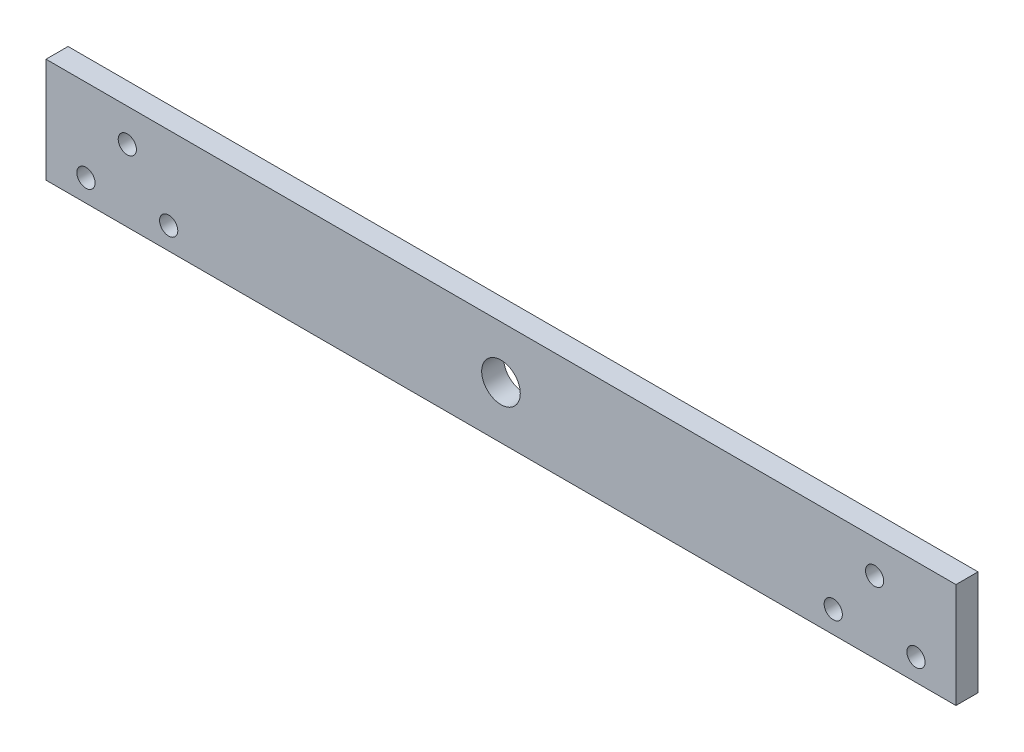
ISO-10303-21;
HEADER;
FILE_DESCRIPTION(('STEP AP214'),'2;1');
FILE_NAME('part.step','',(''),(''),'','','');
FILE_SCHEMA(('AUTOMOTIVE_DESIGN { 1 0 10303 214 1 1 1 1 }'));
ENDSEC;
DATA;
#1=APPLICATION_CONTEXT('core data for automotive mechanical design processes');
#2=APPLICATION_PROTOCOL_DEFINITION('international standard','automotive_design',2000,#1);
#3=PRODUCT_CONTEXT('',#1,'mechanical');
#4=PRODUCT('Part','Part','',(#3));
#5=PRODUCT_RELATED_PRODUCT_CATEGORY('part','',(#4));
#6=PRODUCT_DEFINITION_FORMATION('','',#4);
#7=PRODUCT_DEFINITION_CONTEXT('part definition',#1,'design');
#8=PRODUCT_DEFINITION('design','',#6,#7);
#9=PRODUCT_DEFINITION_SHAPE('','',#8);
#10=(LENGTH_UNIT() NAMED_UNIT(*) SI_UNIT(.MILLI.,.METRE.));
#11=(NAMED_UNIT(*) PLANE_ANGLE_UNIT() SI_UNIT($,.RADIAN.));
#12=(NAMED_UNIT(*) SI_UNIT($,.STERADIAN.) SOLID_ANGLE_UNIT());
#13=UNCERTAINTY_MEASURE_WITH_UNIT(LENGTH_MEASURE(1.E-05),#10,'distance_accuracy_value','');
#14=(GEOMETRIC_REPRESENTATION_CONTEXT(3) GLOBAL_UNCERTAINTY_ASSIGNED_CONTEXT((#13)) GLOBAL_UNIT_ASSIGNED_CONTEXT((#10,
#11,#12)) REPRESENTATION_CONTEXT('',''));
#15=CARTESIAN_POINT('',(0.,0.,0.));
#16=DIRECTION('',(0.,0.,1.));
#17=DIRECTION('',(1.,0.,0.));
#18=AXIS2_PLACEMENT_3D('',#15,#16,#17);
#19=CARTESIAN_POINT('',(-165.,18.9999999999999,8.));
#20=DIRECTION('',(1.,0.,0.));
#21=DIRECTION('',(0.,0.,-1.));
#22=AXIS2_PLACEMENT_3D('',#19,#20,#21);
#23=PLANE('',#22);
#24=DIRECTION('',(0.,-1.,0.));
#25=VECTOR('',#24,1.);
#26=CARTESIAN_POINT('',(-165.,18.9999999999999,0.));
#27=LINE('',#26,#25);
#28=CARTESIAN_POINT('',(-165.,18.9999999999999,0.));
#29=VERTEX_POINT('',#28);
#30=CARTESIAN_POINT('',(-165.,-18.9999999999999,0.));
#31=VERTEX_POINT('',#30);
#32=EDGE_CURVE('E104',#29,#31,#27,.T.);
#33=ORIENTED_EDGE('',*,*,#32,.T.);
#34=DIRECTION('',(0.,0.,-1.));
#35=VECTOR('',#34,1.);
#36=CARTESIAN_POINT('',(-165.,-18.9999999999999,8.));
#37=LINE('',#36,#35);
#38=CARTESIAN_POINT('',(-165.,-18.9999999999999,8.));
#39=VERTEX_POINT('',#38);
#40=EDGE_CURVE('E11',#39,#31,#37,.T.);
#41=ORIENTED_EDGE('',*,*,#40,.F.);
#42=DIRECTION('',(0.,-1.,0.));
#43=VECTOR('',#42,1.);
#44=CARTESIAN_POINT('',(-165.,18.9999999999999,8.));
#45=LINE('',#44,#43);
#46=CARTESIAN_POINT('',(-165.,18.9999999999999,8.));
#47=VERTEX_POINT('',#46);
#48=EDGE_CURVE('E92',#47,#39,#45,.T.);
#49=ORIENTED_EDGE('',*,*,#48,.F.);
#50=DIRECTION('',(0.,0.,-1.));
#51=VECTOR('',#50,1.);
#52=CARTESIAN_POINT('',(-165.,18.9999999999999,8.));
#53=LINE('',#52,#51);
#54=EDGE_CURVE('E100',#47,#29,#53,.T.);
#55=ORIENTED_EDGE('',*,*,#54,.T.);
#56=EDGE_LOOP('',(#33,#41,#49,#55));
#57=FACE_BOUND('',#56,.T.);
#58=ADVANCED_FACE('F41',(#57),#23,.F.);
#59=CARTESIAN_POINT('',(-165.,-18.9999999999999,8.));
#60=DIRECTION('',(0.,1.,0.));
#61=DIRECTION('',(-1.,0.,0.));
#62=AXIS2_PLACEMENT_3D('',#59,#60,#61);
#63=PLANE('',#62);
#64=DIRECTION('',(1.,0.,0.));
#65=VECTOR('',#64,1.);
#66=CARTESIAN_POINT('',(-165.,-18.9999999999999,0.));
#67=LINE('',#66,#65);
#68=CARTESIAN_POINT('',(165.,-19.,0.));
#69=VERTEX_POINT('',#68);
#70=EDGE_CURVE('E96',#31,#69,#67,.T.);
#71=ORIENTED_EDGE('',*,*,#70,.T.);
#72=DIRECTION('',(0.,0.,-1.));
#73=VECTOR('',#72,1.);
#74=CARTESIAN_POINT('',(165.,-19.,8.));
#75=LINE('',#74,#73);
#76=CARTESIAN_POINT('',(165.,-19.,8.));
#77=VERTEX_POINT('',#76);
#78=EDGE_CURVE('E49',#77,#69,#75,.T.);
#79=ORIENTED_EDGE('',*,*,#78,.F.);
#80=DIRECTION('',(1.,0.,0.));
#81=VECTOR('',#80,1.);
#82=CARTESIAN_POINT('',(-165.,-18.9999999999999,8.));
#83=LINE('',#82,#81);
#84=EDGE_CURVE('E87',#39,#77,#83,.T.);
#85=ORIENTED_EDGE('',*,*,#84,.F.);
#86=ORIENTED_EDGE('',*,*,#40,.T.);
#87=EDGE_LOOP('',(#71,#79,#85,#86));
#88=FACE_BOUND('',#87,.T.);
#89=ADVANCED_FACE('F95',(#88),#63,.F.);
#90=CARTESIAN_POINT('',(165.,19.,8.));
#91=DIRECTION('',(-1.,0.,0.));
#92=DIRECTION('',(0.,0.,1.));
#93=AXIS2_PLACEMENT_3D('',#90,#91,#92);
#94=PLANE('',#93);
#95=DIRECTION('',(0.,1.,0.));
#96=VECTOR('',#95,1.);
#97=CARTESIAN_POINT('',(165.,19.,0.));
#98=LINE('',#97,#96);
#99=CARTESIAN_POINT('',(165.,19.,0.));
#100=VERTEX_POINT('',#99);
#101=EDGE_CURVE('E74',#69,#100,#98,.T.);
#102=ORIENTED_EDGE('',*,*,#101,.T.);
#103=DIRECTION('',(0.,0.,-1.));
#104=VECTOR('',#103,1.);
#105=CARTESIAN_POINT('',(165.,19.,8.));
#106=LINE('',#105,#104);
#107=CARTESIAN_POINT('',(165.,19.,8.));
#108=VERTEX_POINT('',#107);
#109=EDGE_CURVE('E97',#108,#100,#106,.T.);
#110=ORIENTED_EDGE('',*,*,#109,.F.);
#111=DIRECTION('',(0.,1.,0.));
#112=VECTOR('',#111,1.);
#113=CARTESIAN_POINT('',(165.,19.,8.));
#114=LINE('',#113,#112);
#115=EDGE_CURVE('E90',#77,#108,#114,.T.);
#116=ORIENTED_EDGE('',*,*,#115,.F.);
#117=ORIENTED_EDGE('',*,*,#78,.T.);
#118=EDGE_LOOP('',(#102,#110,#116,#117));
#119=FACE_BOUND('',#118,.T.);
#120=ADVANCED_FACE('F98',(#119),#94,.F.);
#121=CARTESIAN_POINT('',(-165.,18.9999999999999,8.));
#122=DIRECTION('',(0.,-1.,0.));
#123=DIRECTION('',(1.,0.,0.));
#124=AXIS2_PLACEMENT_3D('',#121,#122,#123);
#125=PLANE('',#124);
#126=DIRECTION('',(-1.,0.,0.));
#127=VECTOR('',#126,1.);
#128=CARTESIAN_POINT('',(-165.,18.9999999999999,0.));
#129=LINE('',#128,#127);
#130=EDGE_CURVE('E80',#100,#29,#129,.T.);
#131=ORIENTED_EDGE('',*,*,#130,.T.);
#132=ORIENTED_EDGE('',*,*,#54,.F.);
#133=DIRECTION('',(-1.,0.,0.));
#134=VECTOR('',#133,1.);
#135=CARTESIAN_POINT('',(-165.,18.9999999999999,8.));
#136=LINE('',#135,#134);
#137=EDGE_CURVE('E57',#108,#47,#136,.T.);
#138=ORIENTED_EDGE('',*,*,#137,.F.);
#139=ORIENTED_EDGE('',*,*,#109,.T.);
#140=EDGE_LOOP('',(#131,#132,#138,#139));
#141=FACE_BOUND('',#140,.T.);
#142=ADVANCED_FACE('F112',(#141),#125,.F.);
#143=CARTESIAN_POINT('',(0.,0.,8.));
#144=DIRECTION('',(0.,0.,1.));
#145=DIRECTION('',(1.,0.,0.));
#146=AXIS2_PLACEMENT_3D('',#143,#144,#145);
#147=PLANE('',#146);
#148=CARTESIAN_POINT('',(120.508311730579,-10.9999999999999,8.));
#149=DIRECTION('',(0.,0.,-1.));
#150=DIRECTION('',(-1.,0.,0.));
#151=AXIS2_PLACEMENT_3D('',#148,#149,#150);
#152=CIRCLE('',#151,3.3);
#153=CARTESIAN_POINT('',(117.208311730579,-10.9999999999999,8.));
#154=VERTEX_POINT('',#153);
#155=EDGE_CURVE('E154',#154,#154,#152,.T.);
#156=ORIENTED_EDGE('',*,*,#155,.T.);
#157=EDGE_LOOP('',(#156));
#158=FACE_BOUND('',#157,.T.);
#159=CARTESIAN_POINT('',(135.508311730579,7.00000000000006,8.));
#160=DIRECTION('',(0.,0.,-1.));
#161=DIRECTION('',(-1.,0.,0.));
#162=AXIS2_PLACEMENT_3D('',#159,#160,#161);
#163=CIRCLE('',#162,3.3);
#164=CARTESIAN_POINT('',(132.208311730579,7.00000000000006,8.));
#165=VERTEX_POINT('',#164);
#166=EDGE_CURVE('E148',#165,#165,#163,.T.);
#167=ORIENTED_EDGE('',*,*,#166,.T.);
#168=EDGE_LOOP('',(#167));
#169=FACE_BOUND('',#168,.T.);
#170=CARTESIAN_POINT('',(150.508311730579,-10.9999999999999,8.));
#171=DIRECTION('',(0.,0.,-1.));
#172=DIRECTION('',(-1.,0.,0.));
#173=AXIS2_PLACEMENT_3D('',#170,#171,#172);
#174=CIRCLE('',#173,3.3);
#175=CARTESIAN_POINT('',(147.208311730579,-10.9999999999999,8.));
#176=VERTEX_POINT('',#175);
#177=EDGE_CURVE('E142',#176,#176,#174,.T.);
#178=ORIENTED_EDGE('',*,*,#177,.T.);
#179=EDGE_LOOP('',(#178));
#180=FACE_BOUND('',#179,.T.);
#181=CARTESIAN_POINT('',(-120.508311730579,-10.9999999999999,8.));
#182=DIRECTION('',(0.,0.,1.));
#183=DIRECTION('',(1.,0.,0.));
#184=AXIS2_PLACEMENT_3D('',#181,#182,#183);
#185=CIRCLE('',#184,3.3);
#186=CARTESIAN_POINT('',(-117.208311730579,-10.9999999999999,8.));
#187=VERTEX_POINT('',#186);
#188=EDGE_CURVE('E137',#187,#187,#185,.T.);
#189=ORIENTED_EDGE('',*,*,#188,.F.);
#190=EDGE_LOOP('',(#189));
#191=FACE_BOUND('',#190,.T.);
#192=CARTESIAN_POINT('',(-135.508311730579,7.00000000000006,8.));
#193=DIRECTION('',(0.,0.,1.));
#194=DIRECTION('',(1.,0.,0.));
#195=AXIS2_PLACEMENT_3D('',#192,#193,#194);
#196=CIRCLE('',#195,3.3);
#197=CARTESIAN_POINT('',(-132.208311730579,7.00000000000006,8.));
#198=VERTEX_POINT('',#197);
#199=EDGE_CURVE('E134',#198,#198,#196,.T.);
#200=ORIENTED_EDGE('',*,*,#199,.F.);
#201=EDGE_LOOP('',(#200));
#202=FACE_BOUND('',#201,.T.);
#203=CARTESIAN_POINT('',(-150.508311730579,-10.9999999999999,8.));
#204=DIRECTION('',(0.,0.,1.));
#205=DIRECTION('',(1.,0.,0.));
#206=AXIS2_PLACEMENT_3D('',#203,#204,#205);
#207=CIRCLE('',#206,3.3);
#208=CARTESIAN_POINT('',(-147.208311730579,-10.9999999999999,8.));
#209=VERTEX_POINT('',#208);
#210=EDGE_CURVE('E127',#209,#209,#207,.T.);
#211=ORIENTED_EDGE('',*,*,#210,.F.);
#212=EDGE_LOOP('',(#211));
#213=FACE_BOUND('',#212,.T.);
#214=CARTESIAN_POINT('',(0.,0.,8.));
#215=DIRECTION('',(0.,0.,1.));
#216=DIRECTION('',(1.,0.,0.));
#217=AXIS2_PLACEMENT_3D('',#214,#215,#216);
#218=CIRCLE('',#217,7.);
#219=CARTESIAN_POINT('',(7.,0.,8.));
#220=VERTEX_POINT('',#219);
#221=EDGE_CURVE('E118',#220,#220,#218,.T.);
#222=ORIENTED_EDGE('',*,*,#221,.F.);
#223=EDGE_LOOP('',(#222));
#224=FACE_BOUND('',#223,.T.);
#225=ORIENTED_EDGE('',*,*,#48,.T.);
#226=ORIENTED_EDGE('',*,*,#84,.T.);
#227=ORIENTED_EDGE('',*,*,#115,.T.);
#228=ORIENTED_EDGE('',*,*,#137,.T.);
#229=EDGE_LOOP('',(#225,#226,#227,#228));
#230=FACE_BOUND('',#229,.T.);
#231=ADVANCED_FACE('F88',(#158,#169,#180,#191,#202,#213,#224,#230),#147,.T.);
#232=CARTESIAN_POINT('',(0.,0.,0.));
#233=DIRECTION('',(0.,0.,1.));
#234=DIRECTION('',(1.,0.,0.));
#235=AXIS2_PLACEMENT_3D('',#232,#233,#234);
#236=PLANE('',#235);
#237=CARTESIAN_POINT('',(120.508311730579,-10.9999999999999,0.));
#238=DIRECTION('',(0.,0.,-1.));
#239=DIRECTION('',(-1.,0.,0.));
#240=AXIS2_PLACEMENT_3D('',#237,#238,#239);
#241=CIRCLE('',#240,3.3);
#242=CARTESIAN_POINT('',(117.208311730579,-10.9999999999999,0.));
#243=VERTEX_POINT('',#242);
#244=EDGE_CURVE('E128',#243,#243,#241,.T.);
#245=ORIENTED_EDGE('',*,*,#244,.F.);
#246=EDGE_LOOP('',(#245));
#247=FACE_BOUND('',#246,.T.);
#248=CARTESIAN_POINT('',(135.508311730579,7.00000000000006,0.));
#249=DIRECTION('',(0.,0.,-1.));
#250=DIRECTION('',(-1.,0.,0.));
#251=AXIS2_PLACEMENT_3D('',#248,#249,#250);
#252=CIRCLE('',#251,3.3);
#253=CARTESIAN_POINT('',(132.208311730579,7.00000000000006,0.));
#254=VERTEX_POINT('',#253);
#255=EDGE_CURVE('E151',#254,#254,#252,.T.);
#256=ORIENTED_EDGE('',*,*,#255,.F.);
#257=EDGE_LOOP('',(#256));
#258=FACE_BOUND('',#257,.T.);
#259=CARTESIAN_POINT('',(150.508311730579,-10.9999999999999,0.));
#260=DIRECTION('',(0.,0.,-1.));
#261=DIRECTION('',(-1.,0.,0.));
#262=AXIS2_PLACEMENT_3D('',#259,#260,#261);
#263=CIRCLE('',#262,3.3);
#264=CARTESIAN_POINT('',(147.208311730579,-10.9999999999999,0.));
#265=VERTEX_POINT('',#264);
#266=EDGE_CURVE('E145',#265,#265,#263,.T.);
#267=ORIENTED_EDGE('',*,*,#266,.F.);
#268=EDGE_LOOP('',(#267));
#269=FACE_BOUND('',#268,.T.);
#270=CARTESIAN_POINT('',(-120.508311730579,-10.9999999999999,0.));
#271=DIRECTION('',(0.,0.,1.));
#272=DIRECTION('',(1.,0.,0.));
#273=AXIS2_PLACEMENT_3D('',#270,#271,#272);
#274=CIRCLE('',#273,3.3);
#275=CARTESIAN_POINT('',(-117.208311730579,-10.9999999999999,0.));
#276=VERTEX_POINT('',#275);
#277=EDGE_CURVE('E121',#276,#276,#274,.T.);
#278=ORIENTED_EDGE('',*,*,#277,.T.);
#279=EDGE_LOOP('',(#278));
#280=FACE_BOUND('',#279,.T.);
#281=CARTESIAN_POINT('',(-135.508311730579,7.00000000000006,0.));
#282=DIRECTION('',(0.,0.,1.));
#283=DIRECTION('',(1.,0.,0.));
#284=AXIS2_PLACEMENT_3D('',#281,#282,#283);
#285=CIRCLE('',#284,3.3);
#286=CARTESIAN_POINT('',(-132.208311730579,7.00000000000006,0.));
#287=VERTEX_POINT('',#286);
#288=EDGE_CURVE('E131',#287,#287,#285,.T.);
#289=ORIENTED_EDGE('',*,*,#288,.T.);
#290=EDGE_LOOP('',(#289));
#291=FACE_BOUND('',#290,.T.);
#292=CARTESIAN_POINT('',(-150.508311730579,-10.9999999999999,0.));
#293=DIRECTION('',(0.,0.,1.));
#294=DIRECTION('',(1.,0.,0.));
#295=AXIS2_PLACEMENT_3D('',#292,#293,#294);
#296=CIRCLE('',#295,3.3);
#297=CARTESIAN_POINT('',(-147.208311730579,-10.9999999999999,0.));
#298=VERTEX_POINT('',#297);
#299=EDGE_CURVE('E124',#298,#298,#296,.T.);
#300=ORIENTED_EDGE('',*,*,#299,.T.);
#301=EDGE_LOOP('',(#300));
#302=FACE_BOUND('',#301,.T.);
#303=CARTESIAN_POINT('',(0.,0.,0.));
#304=DIRECTION('',(0.,0.,1.));
#305=DIRECTION('',(1.,0.,0.));
#306=AXIS2_PLACEMENT_3D('',#303,#304,#305);
#307=CIRCLE('',#306,7.);
#308=CARTESIAN_POINT('',(7.,0.,0.));
#309=VERTEX_POINT('',#308);
#310=EDGE_CURVE('E107',#309,#309,#307,.T.);
#311=ORIENTED_EDGE('',*,*,#310,.T.);
#312=EDGE_LOOP('',(#311));
#313=FACE_BOUND('',#312,.T.);
#314=ORIENTED_EDGE('',*,*,#32,.F.);
#315=ORIENTED_EDGE('',*,*,#130,.F.);
#316=ORIENTED_EDGE('',*,*,#101,.F.);
#317=ORIENTED_EDGE('',*,*,#70,.F.);
#318=EDGE_LOOP('',(#314,#315,#316,#317));
#319=FACE_BOUND('',#318,.T.);
#320=ADVANCED_FACE('F115',(#247,#258,#269,#280,#291,#302,#313,#319),#236,.F.);
#321=CARTESIAN_POINT('',(0.,0.,0.));
#322=DIRECTION('',(0.,0.,1.));
#323=DIRECTION('',(1.,0.,0.));
#324=AXIS2_PLACEMENT_3D('',#321,#322,#323);
#325=CYLINDRICAL_SURFACE('',#324,7.);
#326=ORIENTED_EDGE('',*,*,#310,.F.);
#327=EDGE_LOOP('',(#326));
#328=FACE_BOUND('',#327,.T.);
#329=ORIENTED_EDGE('',*,*,#221,.T.);
#330=EDGE_LOOP('',(#329));
#331=FACE_BOUND('',#330,.T.);
#332=ADVANCED_FACE('F165',(#328,#331),#325,.F.);
#333=CARTESIAN_POINT('',(-150.508311730579,-10.9999999999999,0.));
#334=DIRECTION('',(0.,0.,1.));
#335=DIRECTION('',(1.,0.,0.));
#336=AXIS2_PLACEMENT_3D('',#333,#334,#335);
#337=CYLINDRICAL_SURFACE('',#336,3.3);
#338=ORIENTED_EDGE('',*,*,#299,.F.);
#339=EDGE_LOOP('',(#338));
#340=FACE_BOUND('',#339,.T.);
#341=ORIENTED_EDGE('',*,*,#210,.T.);
#342=EDGE_LOOP('',(#341));
#343=FACE_BOUND('',#342,.T.);
#344=ADVANCED_FACE('F181',(#340,#343),#337,.F.);
#345=CARTESIAN_POINT('',(-135.508311730579,7.00000000000006,0.));
#346=DIRECTION('',(0.,0.,1.));
#347=DIRECTION('',(1.,0.,0.));
#348=AXIS2_PLACEMENT_3D('',#345,#346,#347);
#349=CYLINDRICAL_SURFACE('',#348,3.3);
#350=ORIENTED_EDGE('',*,*,#288,.F.);
#351=EDGE_LOOP('',(#350));
#352=FACE_BOUND('',#351,.T.);
#353=ORIENTED_EDGE('',*,*,#199,.T.);
#354=EDGE_LOOP('',(#353));
#355=FACE_BOUND('',#354,.T.);
#356=ADVANCED_FACE('F222',(#352,#355),#349,.F.);
#357=CARTESIAN_POINT('',(-120.508311730579,-10.9999999999999,0.));
#358=DIRECTION('',(0.,0.,1.));
#359=DIRECTION('',(1.,0.,0.));
#360=AXIS2_PLACEMENT_3D('',#357,#358,#359);
#361=CYLINDRICAL_SURFACE('',#360,3.3);
#362=ORIENTED_EDGE('',*,*,#277,.F.);
#363=EDGE_LOOP('',(#362));
#364=FACE_BOUND('',#363,.T.);
#365=ORIENTED_EDGE('',*,*,#188,.T.);
#366=EDGE_LOOP('',(#365));
#367=FACE_BOUND('',#366,.T.);
#368=ADVANCED_FACE('F230',(#364,#367),#361,.F.);
#369=CARTESIAN_POINT('',(150.508311730579,-10.9999999999999,0.));
#370=DIRECTION('',(0.,0.,1.));
#371=DIRECTION('',(1.,0.,0.));
#372=AXIS2_PLACEMENT_3D('',#369,#370,#371);
#373=CYLINDRICAL_SURFACE('',#372,3.3);
#374=ORIENTED_EDGE('',*,*,#266,.T.);
#375=EDGE_LOOP('',(#374));
#376=FACE_BOUND('',#375,.T.);
#377=ORIENTED_EDGE('',*,*,#177,.F.);
#378=EDGE_LOOP('',(#377));
#379=FACE_BOUND('',#378,.T.);
#380=ADVANCED_FACE('F238',(#376,#379),#373,.F.);
#381=CARTESIAN_POINT('',(135.508311730579,7.00000000000006,0.));
#382=DIRECTION('',(0.,0.,1.));
#383=DIRECTION('',(1.,0.,0.));
#384=AXIS2_PLACEMENT_3D('',#381,#382,#383);
#385=CYLINDRICAL_SURFACE('',#384,3.3);
#386=ORIENTED_EDGE('',*,*,#255,.T.);
#387=EDGE_LOOP('',(#386));
#388=FACE_BOUND('',#387,.T.);
#389=ORIENTED_EDGE('',*,*,#166,.F.);
#390=EDGE_LOOP('',(#389));
#391=FACE_BOUND('',#390,.T.);
#392=ADVANCED_FACE('F251',(#388,#391),#385,.F.);
#393=CARTESIAN_POINT('',(120.508311730579,-10.9999999999999,0.));
#394=DIRECTION('',(0.,0.,1.));
#395=DIRECTION('',(1.,0.,0.));
#396=AXIS2_PLACEMENT_3D('',#393,#394,#395);
#397=CYLINDRICAL_SURFACE('',#396,3.3);
#398=ORIENTED_EDGE('',*,*,#244,.T.);
#399=EDGE_LOOP('',(#398));
#400=FACE_BOUND('',#399,.T.);
#401=ORIENTED_EDGE('',*,*,#155,.F.);
#402=EDGE_LOOP('',(#401));
#403=FACE_BOUND('',#402,.T.);
#404=ADVANCED_FACE('F160',(#400,#403),#397,.F.);
#405=CLOSED_SHELL('',(#58,#89,#120,#142,#231,#320,#332,#344,#356,#368,#380,#392,#404));
#406=MANIFOLD_SOLID_BREP('B2',#405);
#407=ADVANCED_BREP_SHAPE_REPRESENTATION('',(#18,#406),#14);
#408=SHAPE_DEFINITION_REPRESENTATION(#9,#407);
ENDSEC;
END-ISO-10303-21;
